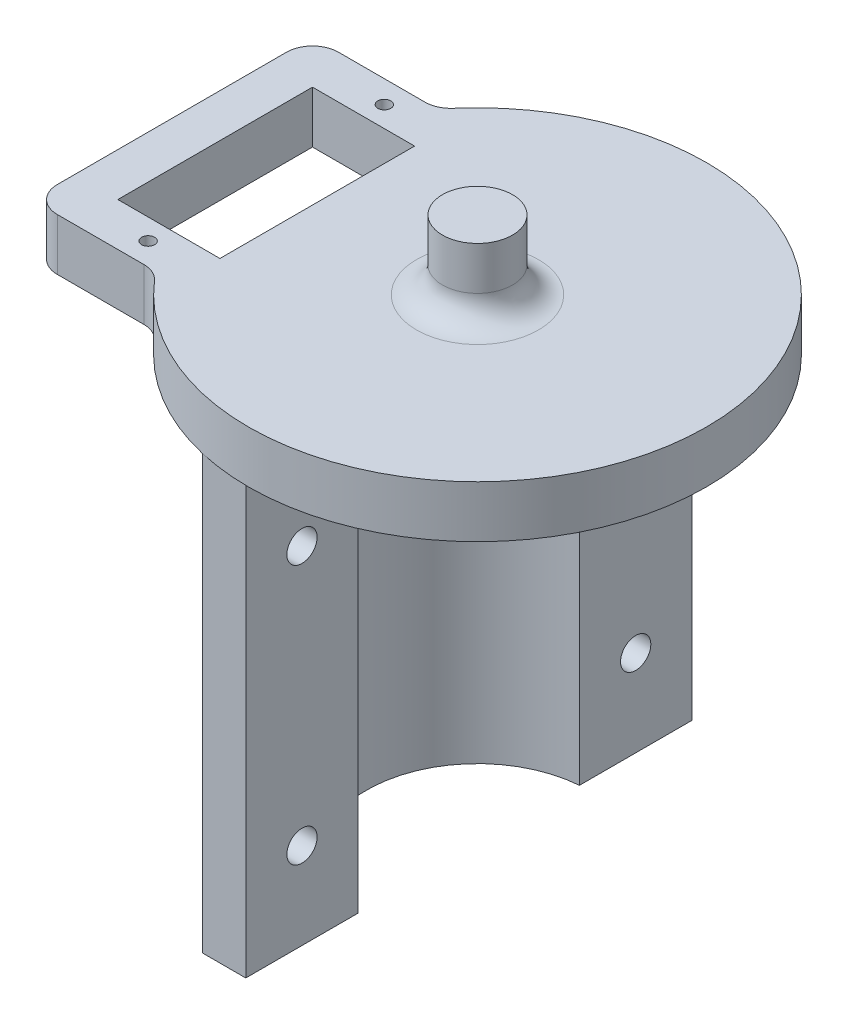
ISO-10303-21;
HEADER;
FILE_DESCRIPTION(('STEP AP214'),'2;1');
FILE_NAME('part.step','',(''),(''),'','','');
FILE_SCHEMA(('AUTOMOTIVE_DESIGN { 1 0 10303 214 1 1 1 1 }'));
ENDSEC;
DATA;
#1=APPLICATION_CONTEXT('core data for automotive mechanical design processes');
#2=APPLICATION_PROTOCOL_DEFINITION('international standard','automotive_design',2000,#1);
#3=PRODUCT_CONTEXT('',#1,'mechanical');
#4=PRODUCT('Part','Part','',(#3));
#5=PRODUCT_RELATED_PRODUCT_CATEGORY('part','',(#4));
#6=PRODUCT_DEFINITION_FORMATION('','',#4);
#7=PRODUCT_DEFINITION_CONTEXT('part definition',#1,'design');
#8=PRODUCT_DEFINITION('design','',#6,#7);
#9=PRODUCT_DEFINITION_SHAPE('','',#8);
#10=(LENGTH_UNIT() NAMED_UNIT(*) SI_UNIT(.MILLI.,.METRE.));
#11=(NAMED_UNIT(*) PLANE_ANGLE_UNIT() SI_UNIT($,.RADIAN.));
#12=(NAMED_UNIT(*) SI_UNIT($,.STERADIAN.) SOLID_ANGLE_UNIT());
#13=UNCERTAINTY_MEASURE_WITH_UNIT(LENGTH_MEASURE(1.E-05),#10,'distance_accuracy_value','');
#14=(GEOMETRIC_REPRESENTATION_CONTEXT(3) GLOBAL_UNCERTAINTY_ASSIGNED_CONTEXT((#13)) GLOBAL_UNIT_ASSIGNED_CONTEXT((#10,
#11,#12)) REPRESENTATION_CONTEXT('',''));
#15=CARTESIAN_POINT('',(0.,0.,0.));
#16=DIRECTION('',(0.,0.,1.));
#17=DIRECTION('',(1.,0.,0.));
#18=AXIS2_PLACEMENT_3D('',#15,#16,#17);
#19=CARTESIAN_POINT('',(-1.,-50.,25.7848331835619));
#20=DIRECTION('',(0.,0.,-1.));
#21=DIRECTION('',(-1.,0.,0.));
#22=AXIS2_PLACEMENT_3D('',#19,#20,#21);
#23=PLANE('',#22);
#24=DIRECTION('',(-1.,0.,0.));
#25=VECTOR('',#24,1.);
#26=CARTESIAN_POINT('',(-1.,0.,25.7848331835619));
#27=LINE('',#26,#25);
#28=CARTESIAN_POINT('',(-1.,0.,25.7848331835619));
#29=VERTEX_POINT('',#28);
#30=CARTESIAN_POINT('',(-6.,0.,25.7848331835619));
#31=VERTEX_POINT('',#30);
#32=EDGE_CURVE('E302',#29,#31,#27,.T.);
#33=ORIENTED_EDGE('',*,*,#32,.T.);
#34=DIRECTION('',(0.,1.,0.));
#35=VECTOR('',#34,1.);
#36=CARTESIAN_POINT('',(-6.,-50.,25.7848331835619));
#37=LINE('',#36,#35);
#38=CARTESIAN_POINT('',(-6.,-50.,25.7848331835619));
#39=VERTEX_POINT('',#38);
#40=EDGE_CURVE('E362',#39,#31,#37,.T.);
#41=ORIENTED_EDGE('',*,*,#40,.F.);
#42=DIRECTION('',(-1.,0.,0.));
#43=VECTOR('',#42,1.);
#44=CARTESIAN_POINT('',(-1.,-50.,25.7848331835619));
#45=LINE('',#44,#43);
#46=CARTESIAN_POINT('',(-1.,-50.,25.7848331835619));
#47=VERTEX_POINT('',#46);
#48=EDGE_CURVE('E303',#47,#39,#45,.T.);
#49=ORIENTED_EDGE('',*,*,#48,.F.);
#50=DIRECTION('',(0.,1.,0.));
#51=VECTOR('',#50,1.);
#52=CARTESIAN_POINT('',(-1.,-50.,25.7848331835619));
#53=LINE('',#52,#51);
#54=EDGE_CURVE('E319',#47,#29,#53,.T.);
#55=ORIENTED_EDGE('',*,*,#54,.T.);
#56=EDGE_LOOP('',(#33,#41,#49,#55));
#57=FACE_BOUND('',#56,.T.);
#58=ADVANCED_FACE('F39',(#57),#23,.F.);
#59=CARTESIAN_POINT('',(-6.,-50.,25.7848331835619));
#60=DIRECTION('',(1.,0.,0.));
#61=DIRECTION('',(0.,0.,-1.));
#62=AXIS2_PLACEMENT_3D('',#59,#60,#61);
#63=PLANE('',#62);
#64=CARTESIAN_POINT('',(-6.,-40.,19.2853936956035));
#65=DIRECTION('',(1.,0.,0.));
#66=DIRECTION('',(0.,0.,-1.));
#67=AXIS2_PLACEMENT_3D('',#64,#65,#66);
#68=CIRCLE('',#67,1.75);
#69=CARTESIAN_POINT('',(-6.,-40.,17.5353936956035));
#70=VERTEX_POINT('',#69);
#71=EDGE_CURVE('E293',#70,#70,#68,.T.);
#72=ORIENTED_EDGE('',*,*,#71,.T.);
#73=EDGE_LOOP('',(#72));
#74=FACE_BOUND('',#73,.T.);
#75=CARTESIAN_POINT('',(-6.,-10.,19.2853936956035));
#76=DIRECTION('',(1.,0.,0.));
#77=DIRECTION('',(0.,0.,-1.));
#78=AXIS2_PLACEMENT_3D('',#75,#76,#77);
#79=CIRCLE('',#78,1.75);
#80=CARTESIAN_POINT('',(-6.,-10.,17.5353936956035));
#81=VERTEX_POINT('',#80);
#82=EDGE_CURVE('E290',#81,#81,#79,.T.);
#83=ORIENTED_EDGE('',*,*,#82,.T.);
#84=EDGE_LOOP('',(#83));
#85=FACE_BOUND('',#84,.T.);
#86=DIRECTION('',(0.,0.,-1.));
#87=VECTOR('',#86,1.);
#88=CARTESIAN_POINT('',(-6.,0.,25.7848331835619));
#89=LINE('',#88,#87);
#90=CARTESIAN_POINT('',(-5.99999999999999,0.,16.7848331835619));
#91=VERTEX_POINT('',#90);
#92=EDGE_CURVE('E322',#31,#91,#89,.T.);
#93=ORIENTED_EDGE('',*,*,#92,.T.);
#94=DIRECTION('',(0.,1.,0.));
#95=VECTOR('',#94,1.);
#96=CARTESIAN_POINT('',(-5.99999999999999,-50.,16.7848331835619));
#97=LINE('',#96,#95);
#98=CARTESIAN_POINT('',(-5.99999999999999,-50.,16.7848331835619));
#99=VERTEX_POINT('',#98);
#100=EDGE_CURVE('E359',#99,#91,#97,.T.);
#101=ORIENTED_EDGE('',*,*,#100,.F.);
#102=DIRECTION('',(0.,0.,-1.));
#103=VECTOR('',#102,1.);
#104=CARTESIAN_POINT('',(-6.,-50.,25.7848331835619));
#105=LINE('',#104,#103);
#106=EDGE_CURVE('E305',#39,#99,#105,.T.);
#107=ORIENTED_EDGE('',*,*,#106,.F.);
#108=ORIENTED_EDGE('',*,*,#40,.T.);
#109=EDGE_LOOP('',(#93,#101,#107,#108));
#110=FACE_BOUND('',#109,.T.);
#111=ADVANCED_FACE('F381',(#74,#85,#110),#63,.F.);
#112=CARTESIAN_POINT('',(0.,-50.,0.));
#113=DIRECTION('',(0.,1.,0.));
#114=DIRECTION('',(0.,0.,1.));
#115=AXIS2_PLACEMENT_3D('',#112,#113,#114);
#116=CYLINDRICAL_SURFACE('',#115,17.825);
#117=CARTESIAN_POINT('',(0.,0.,0.));
#118=DIRECTION('',(0.,-1.,0.));
#119=DIRECTION('',(0.,0.,-1.));
#120=AXIS2_PLACEMENT_3D('',#117,#118,#119);
#121=CIRCLE('',#120,17.825);
#122=CARTESIAN_POINT('',(-6.,0.,-16.7848331835619));
#123=VERTEX_POINT('',#122);
#124=EDGE_CURVE('E325',#91,#123,#121,.T.);
#125=ORIENTED_EDGE('',*,*,#124,.T.);
#126=DIRECTION('',(0.,1.,0.));
#127=VECTOR('',#126,1.);
#128=CARTESIAN_POINT('',(-6.,-50.,-16.7848331835619));
#129=LINE('',#128,#127);
#130=CARTESIAN_POINT('',(-6.,-50.,-16.7848331835619));
#131=VERTEX_POINT('',#130);
#132=EDGE_CURVE('E356',#131,#123,#129,.T.);
#133=ORIENTED_EDGE('',*,*,#132,.F.);
#134=CARTESIAN_POINT('',(0.,-50.,0.));
#135=DIRECTION('',(0.,-1.,0.));
#136=DIRECTION('',(0.,0.,-1.));
#137=AXIS2_PLACEMENT_3D('',#134,#135,#136);
#138=CIRCLE('',#137,17.825);
#139=EDGE_CURVE('E308',#99,#131,#138,.T.);
#140=ORIENTED_EDGE('',*,*,#139,.F.);
#141=ORIENTED_EDGE('',*,*,#100,.T.);
#142=EDGE_LOOP('',(#125,#133,#140,#141));
#143=FACE_BOUND('',#142,.T.);
#144=ADVANCED_FACE('F387',(#143),#116,.T.);
#145=CARTESIAN_POINT('',(-6.,-50.,-16.7848331835619));
#146=DIRECTION('',(1.,0.,0.));
#147=DIRECTION('',(0.,0.,-1.));
#148=AXIS2_PLACEMENT_3D('',#145,#146,#147);
#149=PLANE('',#148);
#150=CARTESIAN_POINT('',(-6.,-10.,-19.2853936956035));
#151=DIRECTION('',(1.,0.,0.));
#152=DIRECTION('',(0.,0.,-1.));
#153=AXIS2_PLACEMENT_3D('',#150,#151,#152);
#154=CIRCLE('',#153,1.75000000000001);
#155=CARTESIAN_POINT('',(-6.,-10.,-21.0353936956035));
#156=VERTEX_POINT('',#155);
#157=EDGE_CURVE('E299',#156,#156,#154,.T.);
#158=ORIENTED_EDGE('',*,*,#157,.T.);
#159=EDGE_LOOP('',(#158));
#160=FACE_BOUND('',#159,.T.);
#161=CARTESIAN_POINT('',(-6.,-40.,-19.2853936956035));
#162=DIRECTION('',(1.,0.,0.));
#163=DIRECTION('',(0.,0.,-1.));
#164=AXIS2_PLACEMENT_3D('',#161,#162,#163);
#165=CIRCLE('',#164,1.75000000000001);
#166=CARTESIAN_POINT('',(-6.,-40.,-21.0353936956036));
#167=VERTEX_POINT('',#166);
#168=EDGE_CURVE('E296',#167,#167,#165,.T.);
#169=ORIENTED_EDGE('',*,*,#168,.T.);
#170=EDGE_LOOP('',(#169));
#171=FACE_BOUND('',#170,.T.);
#172=DIRECTION('',(0.,0.,-1.));
#173=VECTOR('',#172,1.);
#174=CARTESIAN_POINT('',(-6.,0.,-16.7848331835619));
#175=LINE('',#174,#173);
#176=CARTESIAN_POINT('',(-6.,0.,-25.7848331835619));
#177=VERTEX_POINT('',#176);
#178=EDGE_CURVE('E328',#123,#177,#175,.T.);
#179=ORIENTED_EDGE('',*,*,#178,.T.);
#180=DIRECTION('',(0.,1.,0.));
#181=VECTOR('',#180,1.);
#182=CARTESIAN_POINT('',(-6.,-50.,-25.7848331835619));
#183=LINE('',#182,#181);
#184=CARTESIAN_POINT('',(-6.,-50.,-25.7848331835619));
#185=VERTEX_POINT('',#184);
#186=EDGE_CURVE('E353',#185,#177,#183,.T.);
#187=ORIENTED_EDGE('',*,*,#186,.F.);
#188=DIRECTION('',(0.,0.,-1.));
#189=VECTOR('',#188,1.);
#190=CARTESIAN_POINT('',(-6.,-50.,-16.7848331835619));
#191=LINE('',#190,#189);
#192=EDGE_CURVE('E310',#131,#185,#191,.T.);
#193=ORIENTED_EDGE('',*,*,#192,.F.);
#194=ORIENTED_EDGE('',*,*,#132,.T.);
#195=EDGE_LOOP('',(#179,#187,#193,#194));
#196=FACE_BOUND('',#195,.T.);
#197=ADVANCED_FACE('F393',(#160,#171,#196),#149,.F.);
#198=CARTESIAN_POINT('',(-6.,-50.,-25.7848331835619));
#199=DIRECTION('',(0.,0.,1.));
#200=DIRECTION('',(1.,0.,0.));
#201=AXIS2_PLACEMENT_3D('',#198,#199,#200);
#202=PLANE('',#201);
#203=DIRECTION('',(1.,0.,0.));
#204=VECTOR('',#203,1.);
#205=CARTESIAN_POINT('',(-6.,0.,-25.7848331835619));
#206=LINE('',#205,#204);
#207=CARTESIAN_POINT('',(-1.,0.,-25.7848331835619));
#208=VERTEX_POINT('',#207);
#209=EDGE_CURVE('E331',#177,#208,#206,.T.);
#210=ORIENTED_EDGE('',*,*,#209,.T.);
#211=DIRECTION('',(0.,1.,0.));
#212=VECTOR('',#211,1.);
#213=CARTESIAN_POINT('',(-1.,-50.,-25.7848331835619));
#214=LINE('',#213,#212);
#215=CARTESIAN_POINT('',(-1.,-50.,-25.7848331835619));
#216=VERTEX_POINT('',#215);
#217=EDGE_CURVE('E350',#216,#208,#214,.T.);
#218=ORIENTED_EDGE('',*,*,#217,.F.);
#219=DIRECTION('',(1.,0.,0.));
#220=VECTOR('',#219,1.);
#221=CARTESIAN_POINT('',(-6.,-50.,-25.7848331835619));
#222=LINE('',#221,#220);
#223=EDGE_CURVE('E312',#185,#216,#222,.T.);
#224=ORIENTED_EDGE('',*,*,#223,.F.);
#225=ORIENTED_EDGE('',*,*,#186,.T.);
#226=EDGE_LOOP('',(#210,#218,#224,#225));
#227=FACE_BOUND('',#226,.T.);
#228=ADVANCED_FACE('F397',(#227),#202,.F.);
#229=CARTESIAN_POINT('',(-1.,-50.,-25.7848331835619));
#230=DIRECTION('',(-1.,0.,0.));
#231=DIRECTION('',(0.,0.,1.));
#232=AXIS2_PLACEMENT_3D('',#229,#230,#231);
#233=PLANE('',#232);
#234=CARTESIAN_POINT('',(-1.,-10.,-19.2853936956035));
#235=DIRECTION('',(1.,0.,0.));
#236=DIRECTION('',(0.,0.,1.));
#237=AXIS2_PLACEMENT_3D('',#234,#235,#236);
#238=CIRCLE('',#237,1.75000000000001);
#239=CARTESIAN_POINT('',(-1.,-10.,-17.5353936956035));
#240=VERTEX_POINT('',#239);
#241=EDGE_CURVE('E278',#240,#240,#238,.T.);
#242=ORIENTED_EDGE('',*,*,#241,.F.);
#243=EDGE_LOOP('',(#242));
#244=FACE_BOUND('',#243,.T.);
#245=CARTESIAN_POINT('',(-1.,-40.,-19.2853936956035));
#246=DIRECTION('',(1.,0.,0.));
#247=DIRECTION('',(0.,0.,-1.));
#248=AXIS2_PLACEMENT_3D('',#245,#246,#247);
#249=CIRCLE('',#248,1.75000000000001);
#250=CARTESIAN_POINT('',(-1.,-40.,-21.0353936956036));
#251=VERTEX_POINT('',#250);
#252=EDGE_CURVE('E283',#251,#251,#249,.T.);
#253=ORIENTED_EDGE('',*,*,#252,.F.);
#254=EDGE_LOOP('',(#253));
#255=FACE_BOUND('',#254,.T.);
#256=DIRECTION('',(0.,0.,1.));
#257=VECTOR('',#256,1.);
#258=CARTESIAN_POINT('',(-1.,0.,-25.7848331835619));
#259=LINE('',#258,#257);
#260=CARTESIAN_POINT('',(-1.00000000000001,0.,-12.7859542076452));
#261=VERTEX_POINT('',#260);
#262=EDGE_CURVE('E334',#208,#261,#259,.T.);
#263=ORIENTED_EDGE('',*,*,#262,.T.);
#264=DIRECTION('',(0.,1.,0.));
#265=VECTOR('',#264,1.);
#266=CARTESIAN_POINT('',(-1.00000000000001,-50.,-12.7859542076452));
#267=LINE('',#266,#265);
#268=CARTESIAN_POINT('',(-1.00000000000001,-50.,-12.7859542076452));
#269=VERTEX_POINT('',#268);
#270=EDGE_CURVE('E347',#269,#261,#267,.T.);
#271=ORIENTED_EDGE('',*,*,#270,.F.);
#272=DIRECTION('',(0.,0.,1.));
#273=VECTOR('',#272,1.);
#274=CARTESIAN_POINT('',(-1.,-50.,-25.7848331835619));
#275=LINE('',#274,#273);
#276=EDGE_CURVE('E314',#216,#269,#275,.T.);
#277=ORIENTED_EDGE('',*,*,#276,.F.);
#278=ORIENTED_EDGE('',*,*,#217,.T.);
#279=EDGE_LOOP('',(#263,#271,#277,#278));
#280=FACE_BOUND('',#279,.T.);
#281=ADVANCED_FACE('F401',(#244,#255,#280),#233,.F.);
#282=CARTESIAN_POINT('',(0.,-50.,0.));
#283=DIRECTION('',(0.,1.,0.));
#284=DIRECTION('',(0.,0.,1.));
#285=AXIS2_PLACEMENT_3D('',#282,#283,#284);
#286=CYLINDRICAL_SURFACE('',#285,12.825);
#287=CARTESIAN_POINT('',(0.,0.,0.));
#288=DIRECTION('',(0.,1.,0.));
#289=DIRECTION('',(0.,0.,-1.));
#290=AXIS2_PLACEMENT_3D('',#287,#288,#289);
#291=CIRCLE('',#290,12.825);
#292=CARTESIAN_POINT('',(-1.,0.,12.7859542076452));
#293=VERTEX_POINT('',#292);
#294=EDGE_CURVE('E337',#261,#293,#291,.T.);
#295=ORIENTED_EDGE('',*,*,#294,.T.);
#296=DIRECTION('',(0.,1.,0.));
#297=VECTOR('',#296,1.);
#298=CARTESIAN_POINT('',(-1.,-50.,12.7859542076452));
#299=LINE('',#298,#297);
#300=CARTESIAN_POINT('',(-1.,-50.,12.7859542076452));
#301=VERTEX_POINT('',#300);
#302=EDGE_CURVE('E344',#301,#293,#299,.T.);
#303=ORIENTED_EDGE('',*,*,#302,.F.);
#304=CARTESIAN_POINT('',(0.,-50.,0.));
#305=DIRECTION('',(0.,1.,0.));
#306=DIRECTION('',(0.,0.,-1.));
#307=AXIS2_PLACEMENT_3D('',#304,#305,#306);
#308=CIRCLE('',#307,12.825);
#309=EDGE_CURVE('E316',#269,#301,#308,.T.);
#310=ORIENTED_EDGE('',*,*,#309,.F.);
#311=ORIENTED_EDGE('',*,*,#270,.T.);
#312=EDGE_LOOP('',(#295,#303,#310,#311));
#313=FACE_BOUND('',#312,.T.);
#314=ADVANCED_FACE('F405',(#313),#286,.F.);
#315=CARTESIAN_POINT('',(-1.,-50.,25.7848331835619));
#316=DIRECTION('',(-1.,0.,0.));
#317=DIRECTION('',(0.,0.,1.));
#318=AXIS2_PLACEMENT_3D('',#315,#316,#317);
#319=PLANE('',#318);
#320=CARTESIAN_POINT('',(-1.,-40.,19.2853936956035));
#321=DIRECTION('',(1.,0.,0.));
#322=DIRECTION('',(0.,0.,1.));
#323=AXIS2_PLACEMENT_3D('',#320,#321,#322);
#324=CIRCLE('',#323,1.75);
#325=CARTESIAN_POINT('',(-1.,-40.,21.0353936956035));
#326=VERTEX_POINT('',#325);
#327=EDGE_CURVE('E279',#326,#326,#324,.T.);
#328=ORIENTED_EDGE('',*,*,#327,.F.);
#329=EDGE_LOOP('',(#328));
#330=FACE_BOUND('',#329,.T.);
#331=CARTESIAN_POINT('',(-1.,-10.,19.2853936956035));
#332=DIRECTION('',(1.,0.,0.));
#333=DIRECTION('',(0.,0.,-1.));
#334=AXIS2_PLACEMENT_3D('',#331,#332,#333);
#335=CIRCLE('',#334,1.75);
#336=CARTESIAN_POINT('',(-1.,-10.,17.5353936956035));
#337=VERTEX_POINT('',#336);
#338=EDGE_CURVE('E282',#337,#337,#335,.T.);
#339=ORIENTED_EDGE('',*,*,#338,.F.);
#340=EDGE_LOOP('',(#339));
#341=FACE_BOUND('',#340,.T.);
#342=DIRECTION('',(0.,0.,1.));
#343=VECTOR('',#342,1.);
#344=CARTESIAN_POINT('',(-1.,0.,25.7848331835619));
#345=LINE('',#344,#343);
#346=EDGE_CURVE('E306',#293,#29,#345,.T.);
#347=ORIENTED_EDGE('',*,*,#346,.T.);
#348=ORIENTED_EDGE('',*,*,#54,.F.);
#349=DIRECTION('',(0.,0.,1.));
#350=VECTOR('',#349,1.);
#351=CARTESIAN_POINT('',(-1.,-50.,25.7848331835619));
#352=LINE('',#351,#350);
#353=EDGE_CURVE('E55',#301,#47,#352,.T.);
#354=ORIENTED_EDGE('',*,*,#353,.F.);
#355=ORIENTED_EDGE('',*,*,#302,.T.);
#356=EDGE_LOOP('',(#347,#348,#354,#355));
#357=FACE_BOUND('',#356,.T.);
#358=ADVANCED_FACE('F409',(#330,#341,#357),#319,.F.);
#359=CARTESIAN_POINT('',(0.,-50.,0.));
#360=DIRECTION('',(0.,-1.,0.));
#361=DIRECTION('',(0.,0.,-1.));
#362=AXIS2_PLACEMENT_3D('',#359,#360,#361);
#363=PLANE('',#362);
#364=ORIENTED_EDGE('',*,*,#48,.T.);
#365=ORIENTED_EDGE('',*,*,#106,.T.);
#366=ORIENTED_EDGE('',*,*,#139,.T.);
#367=ORIENTED_EDGE('',*,*,#192,.T.);
#368=ORIENTED_EDGE('',*,*,#223,.T.);
#369=ORIENTED_EDGE('',*,*,#276,.T.);
#370=ORIENTED_EDGE('',*,*,#309,.T.);
#371=ORIENTED_EDGE('',*,*,#353,.T.);
#372=EDGE_LOOP('',(#364,#365,#366,#367,#368,#369,#370,#371));
#373=FACE_BOUND('',#372,.T.);
#374=ADVANCED_FACE('F413',(#373),#363,.T.);
#375=CARTESIAN_POINT('',(-17.825,-10.,19.2853936956035));
#376=DIRECTION('',(1.,0.,0.));
#377=DIRECTION('',(0.,0.,-1.));
#378=AXIS2_PLACEMENT_3D('',#375,#376,#377);
#379=CYLINDRICAL_SURFACE('',#378,1.75);
#380=ORIENTED_EDGE('',*,*,#338,.T.);
#381=EDGE_LOOP('',(#380));
#382=FACE_BOUND('',#381,.T.);
#383=ORIENTED_EDGE('',*,*,#82,.F.);
#384=EDGE_LOOP('',(#383));
#385=FACE_BOUND('',#384,.T.);
#386=ADVANCED_FACE('F417',(#382,#385),#379,.F.);
#387=CARTESIAN_POINT('',(-17.825,-40.,19.2853936956035));
#388=DIRECTION('',(1.,0.,0.));
#389=DIRECTION('',(0.,0.,-1.));
#390=AXIS2_PLACEMENT_3D('',#387,#388,#389);
#391=CYLINDRICAL_SURFACE('',#390,1.75);
#392=ORIENTED_EDGE('',*,*,#327,.T.);
#393=EDGE_LOOP('',(#392));
#394=FACE_BOUND('',#393,.T.);
#395=ORIENTED_EDGE('',*,*,#71,.F.);
#396=EDGE_LOOP('',(#395));
#397=FACE_BOUND('',#396,.T.);
#398=ADVANCED_FACE('F420',(#394,#397),#391,.F.);
#399=CARTESIAN_POINT('',(-17.825,-40.,-19.2853936956035));
#400=DIRECTION('',(1.,0.,0.));
#401=DIRECTION('',(0.,0.,-1.));
#402=AXIS2_PLACEMENT_3D('',#399,#400,#401);
#403=CYLINDRICAL_SURFACE('',#402,1.75000000000001);
#404=ORIENTED_EDGE('',*,*,#252,.T.);
#405=EDGE_LOOP('',(#404));
#406=FACE_BOUND('',#405,.T.);
#407=ORIENTED_EDGE('',*,*,#168,.F.);
#408=EDGE_LOOP('',(#407));
#409=FACE_BOUND('',#408,.T.);
#410=ADVANCED_FACE('F425',(#406,#409),#403,.F.);
#411=CARTESIAN_POINT('',(-17.825,-10.,-19.2853936956035));
#412=DIRECTION('',(1.,0.,0.));
#413=DIRECTION('',(0.,0.,-1.));
#414=AXIS2_PLACEMENT_3D('',#411,#412,#413);
#415=CYLINDRICAL_SURFACE('',#414,1.75000000000001);
#416=ORIENTED_EDGE('',*,*,#241,.T.);
#417=EDGE_LOOP('',(#416));
#418=FACE_BOUND('',#417,.T.);
#419=ORIENTED_EDGE('',*,*,#157,.F.);
#420=EDGE_LOOP('',(#419));
#421=FACE_BOUND('',#420,.T.);
#422=ADVANCED_FACE('F422',(#418,#421),#415,.F.);
#423=CARTESIAN_POINT('',(-22.3189922807748,0.,-19.25));
#424=DIRECTION('',(0.,1.,0.));
#425=DIRECTION('',(0.,0.,1.));
#426=AXIS2_PLACEMENT_3D('',#423,#424,#425);
#427=PLANE('',#426);
#428=ORIENTED_EDGE('',*,*,#32,.F.);
#429=ORIENTED_EDGE('',*,*,#346,.F.);
#430=ORIENTED_EDGE('',*,*,#294,.F.);
#431=ORIENTED_EDGE('',*,*,#262,.F.);
#432=ORIENTED_EDGE('',*,*,#209,.F.);
#433=CARTESIAN_POINT('',(0.,0.,0.));
#434=DIRECTION('',(0.,1.,0.));
#435=DIRECTION('',(0.,0.,1.));
#436=AXIS2_PLACEMENT_3D('',#433,#434,#435);
#437=CIRCLE('',#436,26.4737156875289);
#438=EDGE_CURVE('E254',#31,#177,#437,.T.);
#439=ORIENTED_EDGE('',*,*,#438,.F.);
#440=EDGE_LOOP('',(#428,#429,#430,#431,#432,#439));
#441=FACE_BOUND('',#440,.T.);
#442=ADVANCED_FACE('F424',(#441),#427,.F.);
#443=CARTESIAN_POINT('',(-24.4208415088424,0.,13.65));
#444=DIRECTION('',(0.,1.,0.));
#445=DIRECTION('',(0.,0.,1.));
#446=AXIS2_PLACEMENT_3D('',#443,#444,#445);
#447=CIRCLE('',#446,0.749999999999998);
#448=CARTESIAN_POINT('',(-24.4208415088424,0.,14.4));
#449=VERTEX_POINT('',#448);
#450=EDGE_CURVE('E691',#449,#449,#447,.T.);
#451=ORIENTED_EDGE('',*,*,#450,.T.);
#452=EDGE_LOOP('',(#451));
#453=FACE_BOUND('',#452,.T.);
#454=CARTESIAN_POINT('',(-24.4208415088424,0.,-13.65));
#455=DIRECTION('',(0.,1.,0.));
#456=DIRECTION('',(0.,0.,1.));
#457=AXIS2_PLACEMENT_3D('',#454,#455,#456);
#458=CIRCLE('',#457,0.749999999999998);
#459=CARTESIAN_POINT('',(-24.4208415088424,0.,-12.9));
#460=VERTEX_POINT('',#459);
#461=EDGE_CURVE('E695',#460,#460,#458,.T.);
#462=ORIENTED_EDGE('',*,*,#461,.T.);
#463=EDGE_LOOP('',(#462));
#464=FACE_BOUND('',#463,.T.);
#465=DIRECTION('',(0.,0.,1.));
#466=VECTOR('',#465,1.);
#467=CARTESIAN_POINT('',(-30.3208415088424,0.,11.25));
#468=LINE('',#467,#466);
#469=CARTESIAN_POINT('',(-30.3208415088424,0.,-11.25));
#470=VERTEX_POINT('',#469);
#471=CARTESIAN_POINT('',(-30.3208415088424,0.,11.25));
#472=VERTEX_POINT('',#471);
#473=EDGE_CURVE('E205',#470,#472,#468,.T.);
#474=ORIENTED_EDGE('',*,*,#473,.T.);
#475=DIRECTION('',(1.,0.,0.));
#476=VECTOR('',#475,1.);
#477=CARTESIAN_POINT('',(-30.3208415088424,0.,11.25));
#478=LINE('',#477,#476);
#479=CARTESIAN_POINT('',(-18.5208415088424,0.,11.25));
#480=VERTEX_POINT('',#479);
#481=EDGE_CURVE('E190',#472,#480,#478,.T.);
#482=ORIENTED_EDGE('',*,*,#481,.T.);
#483=DIRECTION('',(0.,0.,-1.));
#484=VECTOR('',#483,1.);
#485=CARTESIAN_POINT('',(-18.5208415088424,0.,11.25));
#486=LINE('',#485,#484);
#487=CARTESIAN_POINT('',(-18.5208415088424,0.,-11.25));
#488=VERTEX_POINT('',#487);
#489=EDGE_CURVE('E209',#480,#488,#486,.T.);
#490=ORIENTED_EDGE('',*,*,#489,.T.);
#491=DIRECTION('',(-1.,0.,0.));
#492=VECTOR('',#491,1.);
#493=CARTESIAN_POINT('',(-30.3208415088424,0.,-11.25));
#494=LINE('',#493,#492);
#495=EDGE_CURVE('E184',#488,#470,#494,.T.);
#496=ORIENTED_EDGE('',*,*,#495,.T.);
#497=EDGE_LOOP('',(#474,#482,#490,#496));
#498=FACE_BOUND('',#497,.T.);
#499=ORIENTED_EDGE('',*,*,#178,.F.);
#500=ORIENTED_EDGE('',*,*,#124,.F.);
#501=ORIENTED_EDGE('',*,*,#92,.F.);
#502=CARTESIAN_POINT('',(-20.0472401355014,0.,17.290627092551));
#503=VERTEX_POINT('',#502);
#504=EDGE_CURVE('E222',#503,#31,#437,.T.);
#505=ORIENTED_EDGE('',*,*,#504,.F.);
#506=CARTESIAN_POINT('',(-22.3189922807748,0.,19.25));
#507=DIRECTION('',(0.,-1.,0.));
#508=DIRECTION('',(0.,0.,-1.));
#509=AXIS2_PLACEMENT_3D('',#506,#507,#508);
#510=CIRCLE('',#509,3.);
#511=CARTESIAN_POINT('',(-22.3189922807748,0.,16.25));
#512=VERTEX_POINT('',#511);
#513=EDGE_CURVE('E249',#512,#503,#510,.T.);
#514=ORIENTED_EDGE('',*,*,#513,.F.);
#515=DIRECTION('',(1.,0.,0.));
#516=VECTOR('',#515,1.);
#517=CARTESIAN_POINT('',(-32.3208415088424,0.,16.25));
#518=LINE('',#517,#516);
#519=CARTESIAN_POINT('',(-32.3208415088424,0.,16.25));
#520=VERTEX_POINT('',#519);
#521=EDGE_CURVE('E247',#520,#512,#518,.T.);
#522=ORIENTED_EDGE('',*,*,#521,.F.);
#523=CARTESIAN_POINT('',(-32.3208415088424,0.,13.25));
#524=DIRECTION('',(0.,1.,0.));
#525=DIRECTION('',(0.,0.,-1.));
#526=AXIS2_PLACEMENT_3D('',#523,#524,#525);
#527=CIRCLE('',#526,3.);
#528=CARTESIAN_POINT('',(-35.3208415088424,0.,13.25));
#529=VERTEX_POINT('',#528);
#530=EDGE_CURVE('E245',#529,#520,#527,.T.);
#531=ORIENTED_EDGE('',*,*,#530,.F.);
#532=DIRECTION('',(0.,0.,1.));
#533=VECTOR('',#532,1.);
#534=CARTESIAN_POINT('',(-35.3208415088424,0.,13.25));
#535=LINE('',#534,#533);
#536=CARTESIAN_POINT('',(-35.3208415088424,0.,-13.25));
#537=VERTEX_POINT('',#536);
#538=EDGE_CURVE('E243',#537,#529,#535,.T.);
#539=ORIENTED_EDGE('',*,*,#538,.F.);
#540=CARTESIAN_POINT('',(-32.3208415088424,0.,-13.25));
#541=DIRECTION('',(0.,1.,0.));
#542=DIRECTION('',(0.,0.,-1.));
#543=AXIS2_PLACEMENT_3D('',#540,#541,#542);
#544=CIRCLE('',#543,3.);
#545=CARTESIAN_POINT('',(-32.3208415088424,0.,-16.25));
#546=VERTEX_POINT('',#545);
#547=EDGE_CURVE('E241',#546,#537,#544,.T.);
#548=ORIENTED_EDGE('',*,*,#547,.F.);
#549=DIRECTION('',(-1.,0.,0.));
#550=VECTOR('',#549,1.);
#551=CARTESIAN_POINT('',(-32.3208415088424,0.,-16.25));
#552=LINE('',#551,#550);
#553=CARTESIAN_POINT('',(-22.3189922807748,0.,-16.25));
#554=VERTEX_POINT('',#553);
#555=EDGE_CURVE('E239',#554,#546,#552,.T.);
#556=ORIENTED_EDGE('',*,*,#555,.F.);
#557=CARTESIAN_POINT('',(-22.3189922807748,0.,-19.25));
#558=DIRECTION('',(0.,-1.,0.));
#559=DIRECTION('',(0.,0.,1.));
#560=AXIS2_PLACEMENT_3D('',#557,#558,#559);
#561=CIRCLE('',#560,3.);
#562=CARTESIAN_POINT('',(-20.0472401355014,0.,-17.290627092551));
#563=VERTEX_POINT('',#562);
#564=EDGE_CURVE('E191',#563,#554,#561,.T.);
#565=ORIENTED_EDGE('',*,*,#564,.F.);
#566=EDGE_CURVE('E251',#177,#563,#437,.T.);
#567=ORIENTED_EDGE('',*,*,#566,.F.);
#568=EDGE_LOOP('',(#499,#500,#501,#505,#514,#522,#531,#539,#548,#556,#565,#567));
#569=FACE_BOUND('',#568,.T.);
#570=ADVANCED_FACE('F467',(#453,#464,#498,#569),#427,.F.);
#571=CARTESIAN_POINT('',(-22.3189922807748,6.,-19.25));
#572=DIRECTION('',(0.,1.,0.));
#573=DIRECTION('',(0.,0.,1.));
#574=AXIS2_PLACEMENT_3D('',#571,#572,#573);
#575=PLANE('',#574);
#576=CARTESIAN_POINT('',(0.,6.,0.));
#577=DIRECTION('',(0.,1.,0.));
#578=DIRECTION('',(0.,0.,1.));
#579=AXIS2_PLACEMENT_3D('',#576,#577,#578);
#580=CIRCLE('',#579,7.05);
#581=CARTESIAN_POINT('',(0.,6.,7.05));
#582=VERTEX_POINT('',#581);
#583=EDGE_CURVE('E11',#582,#582,#580,.F.);
#584=ORIENTED_EDGE('',*,*,#583,.T.);
#585=EDGE_LOOP('',(#584));
#586=FACE_BOUND('',#585,.T.);
#587=CARTESIAN_POINT('',(-24.4208415088424,6.,-13.65));
#588=DIRECTION('',(0.,1.,0.));
#589=DIRECTION('',(0.,0.,1.));
#590=AXIS2_PLACEMENT_3D('',#587,#588,#589);
#591=CIRCLE('',#590,0.749999999999998);
#592=CARTESIAN_POINT('',(-24.4208415088424,6.,-12.9));
#593=VERTEX_POINT('',#592);
#594=EDGE_CURVE('E207',#593,#593,#591,.T.);
#595=ORIENTED_EDGE('',*,*,#594,.F.);
#596=EDGE_LOOP('',(#595));
#597=FACE_BOUND('',#596,.T.);
#598=CARTESIAN_POINT('',(-22.3189922807748,6.,-19.25));
#599=DIRECTION('',(0.,-1.,0.));
#600=DIRECTION('',(0.,0.,1.));
#601=AXIS2_PLACEMENT_3D('',#598,#599,#600);
#602=CIRCLE('',#601,3.);
#603=CARTESIAN_POINT('',(-20.0472401355014,6.,-17.290627092551));
#604=VERTEX_POINT('',#603);
#605=CARTESIAN_POINT('',(-22.3189922807748,6.,-16.25));
#606=VERTEX_POINT('',#605);
#607=EDGE_CURVE('E218',#604,#606,#602,.T.);
#608=ORIENTED_EDGE('',*,*,#607,.T.);
#609=DIRECTION('',(-1.,0.,0.));
#610=VECTOR('',#609,1.);
#611=CARTESIAN_POINT('',(-32.3208415088424,6.,-16.25));
#612=LINE('',#611,#610);
#613=CARTESIAN_POINT('',(-32.3208415088424,6.,-16.25));
#614=VERTEX_POINT('',#613);
#615=EDGE_CURVE('E221',#606,#614,#612,.T.);
#616=ORIENTED_EDGE('',*,*,#615,.T.);
#617=CARTESIAN_POINT('',(-32.3208415088424,6.,-13.25));
#618=DIRECTION('',(0.,1.,0.));
#619=DIRECTION('',(0.,0.,-1.));
#620=AXIS2_PLACEMENT_3D('',#617,#618,#619);
#621=CIRCLE('',#620,3.);
#622=CARTESIAN_POINT('',(-35.3208415088424,6.,-13.25));
#623=VERTEX_POINT('',#622);
#624=EDGE_CURVE('E224',#614,#623,#621,.T.);
#625=ORIENTED_EDGE('',*,*,#624,.T.);
#626=DIRECTION('',(0.,0.,1.));
#627=VECTOR('',#626,1.);
#628=CARTESIAN_POINT('',(-35.3208415088424,6.,13.25));
#629=LINE('',#628,#627);
#630=CARTESIAN_POINT('',(-35.3208415088424,6.,13.25));
#631=VERTEX_POINT('',#630);
#632=EDGE_CURVE('E226',#623,#631,#629,.T.);
#633=ORIENTED_EDGE('',*,*,#632,.T.);
#634=CARTESIAN_POINT('',(-32.3208415088424,6.,13.25));
#635=DIRECTION('',(0.,1.,0.));
#636=DIRECTION('',(0.,0.,-1.));
#637=AXIS2_PLACEMENT_3D('',#634,#635,#636);
#638=CIRCLE('',#637,3.);
#639=CARTESIAN_POINT('',(-32.3208415088424,6.,16.25));
#640=VERTEX_POINT('',#639);
#641=EDGE_CURVE('E228',#631,#640,#638,.T.);
#642=ORIENTED_EDGE('',*,*,#641,.T.);
#643=DIRECTION('',(1.,0.,0.));
#644=VECTOR('',#643,1.);
#645=CARTESIAN_POINT('',(-32.3208415088424,6.,16.25));
#646=LINE('',#645,#644);
#647=CARTESIAN_POINT('',(-22.3189922807748,6.,16.25));
#648=VERTEX_POINT('',#647);
#649=EDGE_CURVE('E230',#640,#648,#646,.T.);
#650=ORIENTED_EDGE('',*,*,#649,.T.);
#651=CARTESIAN_POINT('',(-22.3189922807748,6.,19.25));
#652=DIRECTION('',(0.,-1.,0.));
#653=DIRECTION('',(0.,0.,-1.));
#654=AXIS2_PLACEMENT_3D('',#651,#652,#653);
#655=CIRCLE('',#654,3.);
#656=CARTESIAN_POINT('',(-20.0472401355014,6.,17.290627092551));
#657=VERTEX_POINT('',#656);
#658=EDGE_CURVE('E232',#648,#657,#655,.T.);
#659=ORIENTED_EDGE('',*,*,#658,.T.);
#660=CARTESIAN_POINT('',(0.,6.,0.));
#661=DIRECTION('',(0.,1.,0.));
#662=DIRECTION('',(0.,0.,1.));
#663=AXIS2_PLACEMENT_3D('',#660,#661,#662);
#664=CIRCLE('',#663,26.4737156875289);
#665=EDGE_CURVE('E234',#657,#604,#664,.T.);
#666=ORIENTED_EDGE('',*,*,#665,.T.);
#667=EDGE_LOOP('',(#608,#616,#625,#633,#642,#650,#659,#666));
#668=FACE_BOUND('',#667,.T.);
#669=DIRECTION('',(1.,0.,0.));
#670=VECTOR('',#669,1.);
#671=CARTESIAN_POINT('',(-30.3208415088424,6.,11.25));
#672=LINE('',#671,#670);
#673=CARTESIAN_POINT('',(-30.3208415088424,6.,11.25));
#674=VERTEX_POINT('',#673);
#675=CARTESIAN_POINT('',(-18.5208415088424,6.,11.25));
#676=VERTEX_POINT('',#675);
#677=EDGE_CURVE('E183',#674,#676,#672,.T.);
#678=ORIENTED_EDGE('',*,*,#677,.F.);
#679=DIRECTION('',(0.,0.,1.));
#680=VECTOR('',#679,1.);
#681=CARTESIAN_POINT('',(-30.3208415088424,6.,11.25));
#682=LINE('',#681,#680);
#683=CARTESIAN_POINT('',(-30.3208415088424,6.,-11.25));
#684=VERTEX_POINT('',#683);
#685=EDGE_CURVE('E173',#684,#674,#682,.T.);
#686=ORIENTED_EDGE('',*,*,#685,.F.);
#687=DIRECTION('',(-1.,0.,0.));
#688=VECTOR('',#687,1.);
#689=CARTESIAN_POINT('',(-30.3208415088424,6.,-11.25));
#690=LINE('',#689,#688);
#691=CARTESIAN_POINT('',(-18.5208415088424,6.,-11.25));
#692=VERTEX_POINT('',#691);
#693=EDGE_CURVE('E200',#692,#684,#690,.T.);
#694=ORIENTED_EDGE('',*,*,#693,.F.);
#695=DIRECTION('',(0.,0.,-1.));
#696=VECTOR('',#695,1.);
#697=CARTESIAN_POINT('',(-18.5208415088424,6.,11.25));
#698=LINE('',#697,#696);
#699=EDGE_CURVE('E198',#676,#692,#698,.T.);
#700=ORIENTED_EDGE('',*,*,#699,.F.);
#701=EDGE_LOOP('',(#678,#686,#694,#700));
#702=FACE_BOUND('',#701,.T.);
#703=CARTESIAN_POINT('',(-24.4208415088424,6.,13.65));
#704=DIRECTION('',(0.,1.,0.));
#705=DIRECTION('',(0.,0.,1.));
#706=AXIS2_PLACEMENT_3D('',#703,#704,#705);
#707=CIRCLE('',#706,0.749999999999998);
#708=CARTESIAN_POINT('',(-24.4208415088424,6.,14.4));
#709=VERTEX_POINT('',#708);
#710=EDGE_CURVE('E744',#709,#709,#707,.T.);
#711=ORIENTED_EDGE('',*,*,#710,.F.);
#712=EDGE_LOOP('',(#711));
#713=FACE_BOUND('',#712,.T.);
#714=ADVANCED_FACE('F195',(#586,#597,#668,#702,#713),#575,.T.);
#715=CARTESIAN_POINT('',(-22.3189922807748,6.,-19.25));
#716=DIRECTION('',(0.,-1.,0.));
#717=DIRECTION('',(0.,0.,-1.));
#718=AXIS2_PLACEMENT_3D('',#715,#716,#717);
#719=CYLINDRICAL_SURFACE('',#718,3.);
#720=ORIENTED_EDGE('',*,*,#564,.T.);
#721=DIRECTION('',(0.,-1.,0.));
#722=VECTOR('',#721,1.);
#723=CARTESIAN_POINT('',(-22.3189922807748,6.,-16.25));
#724=LINE('',#723,#722);
#725=EDGE_CURVE('E275',#606,#554,#724,.T.);
#726=ORIENTED_EDGE('',*,*,#725,.F.);
#727=ORIENTED_EDGE('',*,*,#607,.F.);
#728=DIRECTION('',(0.,-1.,0.));
#729=VECTOR('',#728,1.);
#730=CARTESIAN_POINT('',(-20.0472401355014,6.,-17.290627092551));
#731=LINE('',#730,#729);
#732=EDGE_CURVE('E236',#604,#563,#731,.T.);
#733=ORIENTED_EDGE('',*,*,#732,.T.);
#734=EDGE_LOOP('',(#720,#726,#727,#733));
#735=FACE_BOUND('',#734,.T.);
#736=ADVANCED_FACE('F433',(#735),#719,.F.);
#737=CARTESIAN_POINT('',(-32.3208415088424,6.,-16.25));
#738=DIRECTION('',(0.,0.,1.));
#739=DIRECTION('',(1.,0.,0.));
#740=AXIS2_PLACEMENT_3D('',#737,#738,#739);
#741=PLANE('',#740);
#742=ORIENTED_EDGE('',*,*,#555,.T.);
#743=DIRECTION('',(0.,-1.,0.));
#744=VECTOR('',#743,1.);
#745=CARTESIAN_POINT('',(-32.3208415088424,6.,-16.25));
#746=LINE('',#745,#744);
#747=EDGE_CURVE('E272',#614,#546,#746,.T.);
#748=ORIENTED_EDGE('',*,*,#747,.F.);
#749=ORIENTED_EDGE('',*,*,#615,.F.);
#750=ORIENTED_EDGE('',*,*,#725,.T.);
#751=EDGE_LOOP('',(#742,#748,#749,#750));
#752=FACE_BOUND('',#751,.T.);
#753=ADVANCED_FACE('F436',(#752),#741,.F.);
#754=CARTESIAN_POINT('',(-32.3208415088424,6.,-13.25));
#755=DIRECTION('',(0.,-1.,0.));
#756=DIRECTION('',(0.,0.,-1.));
#757=AXIS2_PLACEMENT_3D('',#754,#755,#756);
#758=CYLINDRICAL_SURFACE('',#757,3.);
#759=ORIENTED_EDGE('',*,*,#547,.T.);
#760=DIRECTION('',(0.,-1.,0.));
#761=VECTOR('',#760,1.);
#762=CARTESIAN_POINT('',(-35.3208415088424,6.,-13.25));
#763=LINE('',#762,#761);
#764=EDGE_CURVE('E269',#623,#537,#763,.T.);
#765=ORIENTED_EDGE('',*,*,#764,.F.);
#766=ORIENTED_EDGE('',*,*,#624,.F.);
#767=ORIENTED_EDGE('',*,*,#747,.T.);
#768=EDGE_LOOP('',(#759,#765,#766,#767));
#769=FACE_BOUND('',#768,.T.);
#770=ADVANCED_FACE('F440',(#769),#758,.T.);
#771=CARTESIAN_POINT('',(-35.3208415088424,6.,13.25));
#772=DIRECTION('',(1.,0.,0.));
#773=DIRECTION('',(0.,0.,-1.));
#774=AXIS2_PLACEMENT_3D('',#771,#772,#773);
#775=PLANE('',#774);
#776=ORIENTED_EDGE('',*,*,#538,.T.);
#777=DIRECTION('',(0.,-1.,0.));
#778=VECTOR('',#777,1.);
#779=CARTESIAN_POINT('',(-35.3208415088424,6.,13.25));
#780=LINE('',#779,#778);
#781=EDGE_CURVE('E266',#631,#529,#780,.T.);
#782=ORIENTED_EDGE('',*,*,#781,.F.);
#783=ORIENTED_EDGE('',*,*,#632,.F.);
#784=ORIENTED_EDGE('',*,*,#764,.T.);
#785=EDGE_LOOP('',(#776,#782,#783,#784));
#786=FACE_BOUND('',#785,.T.);
#787=ADVANCED_FACE('F444',(#786),#775,.F.);
#788=CARTESIAN_POINT('',(-32.3208415088424,6.,13.25));
#789=DIRECTION('',(0.,-1.,0.));
#790=DIRECTION('',(0.,0.,-1.));
#791=AXIS2_PLACEMENT_3D('',#788,#789,#790);
#792=CYLINDRICAL_SURFACE('',#791,3.);
#793=ORIENTED_EDGE('',*,*,#530,.T.);
#794=DIRECTION('',(0.,-1.,0.));
#795=VECTOR('',#794,1.);
#796=CARTESIAN_POINT('',(-32.3208415088424,6.,16.25));
#797=LINE('',#796,#795);
#798=EDGE_CURVE('E263',#640,#520,#797,.T.);
#799=ORIENTED_EDGE('',*,*,#798,.F.);
#800=ORIENTED_EDGE('',*,*,#641,.F.);
#801=ORIENTED_EDGE('',*,*,#781,.T.);
#802=EDGE_LOOP('',(#793,#799,#800,#801));
#803=FACE_BOUND('',#802,.T.);
#804=ADVANCED_FACE('F448',(#803),#792,.T.);
#805=CARTESIAN_POINT('',(-32.3208415088424,6.,16.25));
#806=DIRECTION('',(0.,0.,-1.));
#807=DIRECTION('',(-1.,0.,0.));
#808=AXIS2_PLACEMENT_3D('',#805,#806,#807);
#809=PLANE('',#808);
#810=ORIENTED_EDGE('',*,*,#521,.T.);
#811=DIRECTION('',(0.,-1.,0.));
#812=VECTOR('',#811,1.);
#813=CARTESIAN_POINT('',(-22.3189922807748,6.,16.25));
#814=LINE('',#813,#812);
#815=EDGE_CURVE('E260',#648,#512,#814,.T.);
#816=ORIENTED_EDGE('',*,*,#815,.F.);
#817=ORIENTED_EDGE('',*,*,#649,.F.);
#818=ORIENTED_EDGE('',*,*,#798,.T.);
#819=EDGE_LOOP('',(#810,#816,#817,#818));
#820=FACE_BOUND('',#819,.T.);
#821=ADVANCED_FACE('F452',(#820),#809,.F.);
#822=CARTESIAN_POINT('',(-22.3189922807748,6.,19.25));
#823=DIRECTION('',(0.,-1.,0.));
#824=DIRECTION('',(0.,0.,-1.));
#825=AXIS2_PLACEMENT_3D('',#822,#823,#824);
#826=CYLINDRICAL_SURFACE('',#825,3.);
#827=ORIENTED_EDGE('',*,*,#513,.T.);
#828=DIRECTION('',(0.,-1.,0.));
#829=VECTOR('',#828,1.);
#830=CARTESIAN_POINT('',(-20.0472401355014,6.,17.290627092551));
#831=LINE('',#830,#829);
#832=EDGE_CURVE('E257',#657,#503,#831,.T.);
#833=ORIENTED_EDGE('',*,*,#832,.F.);
#834=ORIENTED_EDGE('',*,*,#658,.F.);
#835=ORIENTED_EDGE('',*,*,#815,.T.);
#836=EDGE_LOOP('',(#827,#833,#834,#835));
#837=FACE_BOUND('',#836,.T.);
#838=ADVANCED_FACE('F456',(#837),#826,.F.);
#839=CARTESIAN_POINT('',(0.,6.,0.));
#840=DIRECTION('',(0.,-1.,0.));
#841=DIRECTION('',(0.,0.,-1.));
#842=AXIS2_PLACEMENT_3D('',#839,#840,#841);
#843=CYLINDRICAL_SURFACE('',#842,26.4737156875289);
#844=ORIENTED_EDGE('',*,*,#504,.T.);
#845=ORIENTED_EDGE('',*,*,#438,.T.);
#846=ORIENTED_EDGE('',*,*,#566,.T.);
#847=ORIENTED_EDGE('',*,*,#732,.F.);
#848=ORIENTED_EDGE('',*,*,#665,.F.);
#849=ORIENTED_EDGE('',*,*,#832,.T.);
#850=EDGE_LOOP('',(#844,#845,#846,#847,#848,#849));
#851=FACE_BOUND('',#850,.T.);
#852=ADVANCED_FACE('F460',(#851),#843,.T.);
#853=CARTESIAN_POINT('',(-30.3208415088424,6.,11.25));
#854=DIRECTION('',(1.,0.,0.));
#855=DIRECTION('',(0.,0.,-1.));
#856=AXIS2_PLACEMENT_3D('',#853,#854,#855);
#857=PLANE('',#856);
#858=ORIENTED_EDGE('',*,*,#473,.F.);
#859=DIRECTION('',(0.,-1.,0.));
#860=VECTOR('',#859,1.);
#861=CARTESIAN_POINT('',(-30.3208415088424,6.,-11.25));
#862=LINE('',#861,#860);
#863=EDGE_CURVE('E179',#684,#470,#862,.T.);
#864=ORIENTED_EDGE('',*,*,#863,.F.);
#865=ORIENTED_EDGE('',*,*,#685,.T.);
#866=DIRECTION('',(0.,-1.,0.));
#867=VECTOR('',#866,1.);
#868=CARTESIAN_POINT('',(-30.3208415088424,6.,11.25));
#869=LINE('',#868,#867);
#870=EDGE_CURVE('E176',#674,#472,#869,.T.);
#871=ORIENTED_EDGE('',*,*,#870,.T.);
#872=EDGE_LOOP('',(#858,#864,#865,#871));
#873=FACE_BOUND('',#872,.T.);
#874=ADVANCED_FACE('F175',(#873),#857,.T.);
#875=CARTESIAN_POINT('',(-30.3208415088424,6.,11.25));
#876=DIRECTION('',(0.,0.,-1.));
#877=DIRECTION('',(-1.,0.,0.));
#878=AXIS2_PLACEMENT_3D('',#875,#876,#877);
#879=PLANE('',#878);
#880=ORIENTED_EDGE('',*,*,#481,.F.);
#881=ORIENTED_EDGE('',*,*,#870,.F.);
#882=ORIENTED_EDGE('',*,*,#677,.T.);
#883=DIRECTION('',(0.,-1.,0.));
#884=VECTOR('',#883,1.);
#885=CARTESIAN_POINT('',(-18.5208415088424,6.,11.25));
#886=LINE('',#885,#884);
#887=EDGE_CURVE('E192',#676,#480,#886,.T.);
#888=ORIENTED_EDGE('',*,*,#887,.T.);
#889=EDGE_LOOP('',(#880,#881,#882,#888));
#890=FACE_BOUND('',#889,.T.);
#891=ADVANCED_FACE('F187',(#890),#879,.T.);
#892=CARTESIAN_POINT('',(-18.5208415088424,6.,11.25));
#893=DIRECTION('',(-1.,0.,0.));
#894=DIRECTION('',(0.,0.,1.));
#895=AXIS2_PLACEMENT_3D('',#892,#893,#894);
#896=PLANE('',#895);
#897=ORIENTED_EDGE('',*,*,#489,.F.);
#898=ORIENTED_EDGE('',*,*,#887,.F.);
#899=ORIENTED_EDGE('',*,*,#699,.T.);
#900=DIRECTION('',(0.,-1.,0.));
#901=VECTOR('',#900,1.);
#902=CARTESIAN_POINT('',(-18.5208415088424,6.,-11.25));
#903=LINE('',#902,#901);
#904=EDGE_CURVE('E215',#692,#488,#903,.T.);
#905=ORIENTED_EDGE('',*,*,#904,.T.);
#906=EDGE_LOOP('',(#897,#898,#899,#905));
#907=FACE_BOUND('',#906,.T.);
#908=ADVANCED_FACE('F476',(#907),#896,.T.);
#909=CARTESIAN_POINT('',(-30.3208415088424,6.,-11.25));
#910=DIRECTION('',(0.,0.,1.));
#911=DIRECTION('',(1.,0.,0.));
#912=AXIS2_PLACEMENT_3D('',#909,#910,#911);
#913=PLANE('',#912);
#914=ORIENTED_EDGE('',*,*,#495,.F.);
#915=ORIENTED_EDGE('',*,*,#904,.F.);
#916=ORIENTED_EDGE('',*,*,#693,.T.);
#917=ORIENTED_EDGE('',*,*,#863,.T.);
#918=EDGE_LOOP('',(#914,#915,#916,#917));
#919=FACE_BOUND('',#918,.T.);
#920=ADVANCED_FACE('F479',(#919),#913,.T.);
#921=CARTESIAN_POINT('',(-24.4208415088424,6.,-13.65));
#922=DIRECTION('',(0.,-1.,0.));
#923=DIRECTION('',(0.,0.,-1.));
#924=AXIS2_PLACEMENT_3D('',#921,#922,#923);
#925=CYLINDRICAL_SURFACE('',#924,0.749999999999998);
#926=ORIENTED_EDGE('',*,*,#594,.T.);
#927=EDGE_LOOP('',(#926));
#928=FACE_BOUND('',#927,.T.);
#929=ORIENTED_EDGE('',*,*,#461,.F.);
#930=EDGE_LOOP('',(#929));
#931=FACE_BOUND('',#930,.T.);
#932=ADVANCED_FACE('F483',(#928,#931),#925,.F.);
#933=CARTESIAN_POINT('',(-24.4208415088424,6.,13.65));
#934=DIRECTION('',(0.,-1.,0.));
#935=DIRECTION('',(0.,0.,-1.));
#936=AXIS2_PLACEMENT_3D('',#933,#934,#935);
#937=CYLINDRICAL_SURFACE('',#936,0.749999999999998);
#938=ORIENTED_EDGE('',*,*,#710,.T.);
#939=EDGE_LOOP('',(#938));
#940=FACE_BOUND('',#939,.T.);
#941=ORIENTED_EDGE('',*,*,#450,.F.);
#942=EDGE_LOOP('',(#941));
#943=FACE_BOUND('',#942,.T.);
#944=ADVANCED_FACE('F487',(#940,#943),#937,.F.);
#945=CARTESIAN_POINT('',(0.,14.,0.));
#946=DIRECTION('',(0.,-1.,0.));
#947=DIRECTION('',(0.,0.,-1.));
#948=AXIS2_PLACEMENT_3D('',#945,#946,#947);
#949=CYLINDRICAL_SURFACE('',#948,4.05);
#950=CARTESIAN_POINT('',(0.,9.,0.));
#951=DIRECTION('',(0.,1.,0.));
#952=DIRECTION('',(0.,0.,1.));
#953=AXIS2_PLACEMENT_3D('',#950,#951,#952);
#954=CIRCLE('',#953,4.05);
#955=CARTESIAN_POINT('',(0.,9.,4.05));
#956=VERTEX_POINT('',#955);
#957=EDGE_CURVE('E48',#956,#956,#954,.T.);
#958=ORIENTED_EDGE('',*,*,#957,.T.);
#959=EDGE_LOOP('',(#958));
#960=FACE_BOUND('',#959,.T.);
#961=CARTESIAN_POINT('',(0.,14.,0.));
#962=DIRECTION('',(0.,1.,0.));
#963=DIRECTION('',(0.,0.,1.));
#964=AXIS2_PLACEMENT_3D('',#961,#962,#963);
#965=CIRCLE('',#964,4.05);
#966=CARTESIAN_POINT('',(0.,14.,4.05));
#967=VERTEX_POINT('',#966);
#968=EDGE_CURVE('E750',#967,#967,#965,.T.);
#969=ORIENTED_EDGE('',*,*,#968,.F.);
#970=EDGE_LOOP('',(#969));
#971=FACE_BOUND('',#970,.T.);
#972=ADVANCED_FACE('F367',(#960,#971),#949,.T.);
#973=CARTESIAN_POINT('',(0.,14.,0.));
#974=DIRECTION('',(0.,1.,0.));
#975=DIRECTION('',(0.,0.,1.));
#976=AXIS2_PLACEMENT_3D('',#973,#974,#975);
#977=PLANE('',#976);
#978=ORIENTED_EDGE('',*,*,#968,.T.);
#979=EDGE_LOOP('',(#978));
#980=FACE_BOUND('',#979,.T.);
#981=ADVANCED_FACE('F371',(#980),#977,.T.);
#982=CARTESIAN_POINT('',(0.,9.,0.));
#983=DIRECTION('',(0.,1.,0.));
#984=DIRECTION('',(0.,0.,1.));
#985=AXIS2_PLACEMENT_3D('',#982,#983,#984);
#986=TOROIDAL_SURFACE('',#985,7.05,3.);
#987=ORIENTED_EDGE('',*,*,#583,.F.);
#988=EDGE_LOOP('',(#987));
#989=FACE_BOUND('',#988,.T.);
#990=ORIENTED_EDGE('',*,*,#957,.F.);
#991=EDGE_LOOP('',(#990));
#992=FACE_BOUND('',#991,.T.);
#993=ADVANCED_FACE('F41',(#989,#992),#986,.F.);
#994=CLOSED_SHELL('',(#58,#111,#144,#197,#228,#281,#314,#358,#374,#386,#398,#410,#422,#442,#570,
#714,#736,#753,#770,#787,#804,#821,#838,#852,#874,#891,#908,#920,#932,#944,#972,#981,#993));
#995=MANIFOLD_SOLID_BREP('B2',#994);
#996=ADVANCED_BREP_SHAPE_REPRESENTATION('',(#18,#995),#14);
#997=SHAPE_DEFINITION_REPRESENTATION(#9,#996);
ENDSEC;
END-ISO-10303-21;
